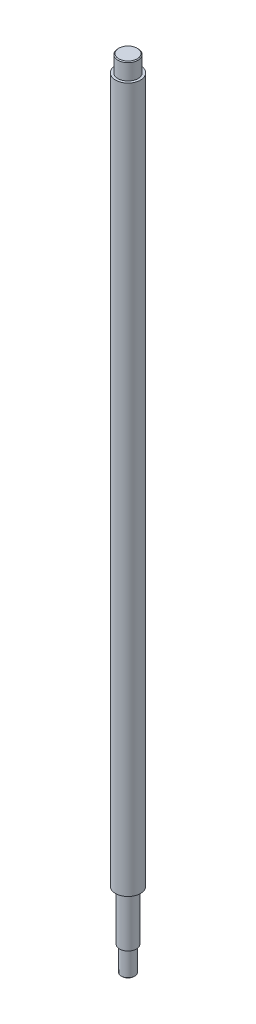
ISO-10303-21;
HEADER;
FILE_DESCRIPTION(('STEP AP214'),'2;1');
FILE_NAME('part.step','',(''),(''),'','','');
FILE_SCHEMA(('AUTOMOTIVE_DESIGN { 1 0 10303 214 1 1 1 1 }'));
ENDSEC;
DATA;
#1=APPLICATION_CONTEXT('core data for automotive mechanical design processes');
#2=APPLICATION_PROTOCOL_DEFINITION('international standard','automotive_design',2000,#1);
#3=PRODUCT_CONTEXT('',#1,'mechanical');
#4=PRODUCT('Part','Part','',(#3));
#5=PRODUCT_RELATED_PRODUCT_CATEGORY('part','',(#4));
#6=PRODUCT_DEFINITION_FORMATION('','',#4);
#7=PRODUCT_DEFINITION_CONTEXT('part definition',#1,'design');
#8=PRODUCT_DEFINITION('design','',#6,#7);
#9=PRODUCT_DEFINITION_SHAPE('','',#8);
#10=(LENGTH_UNIT() NAMED_UNIT(*) SI_UNIT(.MILLI.,.METRE.));
#11=(NAMED_UNIT(*) PLANE_ANGLE_UNIT() SI_UNIT($,.RADIAN.));
#12=(NAMED_UNIT(*) SI_UNIT($,.STERADIAN.) SOLID_ANGLE_UNIT());
#13=UNCERTAINTY_MEASURE_WITH_UNIT(LENGTH_MEASURE(1.E-05),#10,'distance_accuracy_value','');
#14=(GEOMETRIC_REPRESENTATION_CONTEXT(3) GLOBAL_UNCERTAINTY_ASSIGNED_CONTEXT((#13)) GLOBAL_UNIT_ASSIGNED_CONTEXT((#10,
#11,#12)) REPRESENTATION_CONTEXT('',''));
#15=CARTESIAN_POINT('',(0.,0.,0.));
#16=DIRECTION('',(0.,0.,1.));
#17=DIRECTION('',(1.,0.,0.));
#18=AXIS2_PLACEMENT_3D('',#15,#16,#17);
#19=CARTESIAN_POINT('',(0.,-30.,0.));
#20=DIRECTION('',(0.,-1.,0.));
#21=DIRECTION('',(0.,0.,-1.));
#22=AXIS2_PLACEMENT_3D('',#19,#20,#21);
#23=PLANE('',#22);
#24=CARTESIAN_POINT('',(0.,-30.,0.));
#25=DIRECTION('',(0.,-1.,0.));
#26=DIRECTION('',(0.,0.,-1.));
#27=AXIS2_PLACEMENT_3D('',#24,#25,#26);
#28=CIRCLE('',#27,5.);
#29=CARTESIAN_POINT('',(0.,-30.,-5.));
#30=VERTEX_POINT('',#29);
#31=EDGE_CURVE('E64',#30,#30,#28,.T.);
#32=ORIENTED_EDGE('',*,*,#31,.T.);
#33=EDGE_LOOP('',(#32));
#34=FACE_BOUND('',#33,.T.);
#35=CARTESIAN_POINT('',(0.,-30.,0.));
#36=DIRECTION('',(0.,-1.,0.));
#37=DIRECTION('',(0.,0.,-1.));
#38=AXIS2_PLACEMENT_3D('',#35,#36,#37);
#39=CIRCLE('',#38,4.);
#40=CARTESIAN_POINT('',(0.,-30.,-4.));
#41=VERTEX_POINT('',#40);
#42=EDGE_CURVE('E67',#41,#41,#39,.T.);
#43=ORIENTED_EDGE('',*,*,#42,.F.);
#44=EDGE_LOOP('',(#43));
#45=FACE_BOUND('',#44,.T.);
#46=ADVANCED_FACE('F32',(#34,#45),#23,.T.);
#47=CARTESIAN_POINT('',(0.,0.,0.));
#48=DIRECTION('',(0.,1.,0.));
#49=DIRECTION('',(0.,0.,1.));
#50=AXIS2_PLACEMENT_3D('',#47,#48,#49);
#51=PLANE('',#50);
#52=CARTESIAN_POINT('',(0.,0.,0.));
#53=DIRECTION('',(0.,1.,0.));
#54=DIRECTION('',(0.,0.,1.));
#55=AXIS2_PLACEMENT_3D('',#52,#53,#54);
#56=CIRCLE('',#55,7.5);
#57=CARTESIAN_POINT('',(0.,0.,7.5));
#58=VERTEX_POINT('',#57);
#59=EDGE_CURVE('E56',#58,#58,#56,.T.);
#60=ORIENTED_EDGE('',*,*,#59,.F.);
#61=EDGE_LOOP('',(#60));
#62=FACE_BOUND('',#61,.T.);
#63=CARTESIAN_POINT('',(0.,0.,0.));
#64=DIRECTION('',(0.,1.,0.));
#65=DIRECTION('',(0.,0.,1.));
#66=AXIS2_PLACEMENT_3D('',#63,#64,#65);
#67=CIRCLE('',#66,5.);
#68=CARTESIAN_POINT('',(0.,0.,5.));
#69=VERTEX_POINT('',#68);
#70=EDGE_CURVE('E43',#69,#69,#67,.F.);
#71=ORIENTED_EDGE('',*,*,#70,.F.);
#72=EDGE_LOOP('',(#71));
#73=FACE_BOUND('',#72,.T.);
#74=ADVANCED_FACE('F74',(#62,#73),#51,.F.);
#75=CARTESIAN_POINT('',(0.,421.,0.));
#76=DIRECTION('',(0.,1.,0.));
#77=DIRECTION('',(0.,0.,1.));
#78=AXIS2_PLACEMENT_3D('',#75,#76,#77);
#79=PLANE('',#78);
#80=CARTESIAN_POINT('',(0.,421.,0.));
#81=DIRECTION('',(0.,1.,0.));
#82=DIRECTION('',(0.,0.,1.));
#83=AXIS2_PLACEMENT_3D('',#80,#81,#82);
#84=CIRCLE('',#83,7.5);
#85=CARTESIAN_POINT('',(0.,421.,7.5));
#86=VERTEX_POINT('',#85);
#87=EDGE_CURVE('E55',#86,#86,#84,.T.);
#88=ORIENTED_EDGE('',*,*,#87,.T.);
#89=EDGE_LOOP('',(#88));
#90=FACE_BOUND('',#89,.T.);
#91=CARTESIAN_POINT('',(0.,421.,0.));
#92=DIRECTION('',(0.,1.,0.));
#93=DIRECTION('',(0.,0.,1.));
#94=AXIS2_PLACEMENT_3D('',#91,#92,#93);
#95=CIRCLE('',#94,6.);
#96=CARTESIAN_POINT('',(0.,421.,6.));
#97=VERTEX_POINT('',#96);
#98=EDGE_CURVE('E59',#97,#97,#95,.T.);
#99=ORIENTED_EDGE('',*,*,#98,.F.);
#100=EDGE_LOOP('',(#99));
#101=FACE_BOUND('',#100,.T.);
#102=ADVANCED_FACE('F80',(#90,#101),#79,.T.);
#103=CARTESIAN_POINT('',(0.,421.,0.));
#104=DIRECTION('',(0.,-1.,0.));
#105=DIRECTION('',(0.,0.,-1.));
#106=AXIS2_PLACEMENT_3D('',#103,#104,#105);
#107=CYLINDRICAL_SURFACE('',#106,7.5);
#108=ORIENTED_EDGE('',*,*,#87,.F.);
#109=EDGE_LOOP('',(#108));
#110=FACE_BOUND('',#109,.T.);
#111=ORIENTED_EDGE('',*,*,#59,.T.);
#112=EDGE_LOOP('',(#111));
#113=FACE_BOUND('',#112,.T.);
#114=ADVANCED_FACE('F98',(#110,#113),#107,.T.);
#115=CARTESIAN_POINT('',(0.,431.,0.));
#116=DIRECTION('',(0.,-1.,0.));
#117=DIRECTION('',(0.,0.,-1.));
#118=AXIS2_PLACEMENT_3D('',#115,#116,#117);
#119=CYLINDRICAL_SURFACE('',#118,6.);
#120=CARTESIAN_POINT('',(0.,430.5,0.));
#121=DIRECTION('',(0.,1.,0.));
#122=DIRECTION('',(0.,0.,1.));
#123=AXIS2_PLACEMENT_3D('',#120,#121,#122);
#124=CIRCLE('',#123,6.);
#125=CARTESIAN_POINT('',(0.,430.5,6.));
#126=VERTEX_POINT('',#125);
#127=EDGE_CURVE('E47',#126,#126,#124,.F.);
#128=ORIENTED_EDGE('',*,*,#127,.T.);
#129=EDGE_LOOP('',(#128));
#130=FACE_BOUND('',#129,.T.);
#131=ORIENTED_EDGE('',*,*,#98,.T.);
#132=EDGE_LOOP('',(#131));
#133=FACE_BOUND('',#132,.T.);
#134=ADVANCED_FACE('F94',(#130,#133),#119,.T.);
#135=CARTESIAN_POINT('',(0.,431.,0.));
#136=DIRECTION('',(0.,1.,0.));
#137=DIRECTION('',(0.,0.,1.));
#138=AXIS2_PLACEMENT_3D('',#135,#136,#137);
#139=PLANE('',#138);
#140=CARTESIAN_POINT('',(0.,431.,0.));
#141=DIRECTION('',(0.,1.,0.));
#142=DIRECTION('',(0.,0.,1.));
#143=AXIS2_PLACEMENT_3D('',#140,#141,#142);
#144=CIRCLE('',#143,5.49999999999995);
#145=CARTESIAN_POINT('',(0.,431.,5.49999999999995));
#146=VERTEX_POINT('',#145);
#147=EDGE_CURVE('E52',#146,#146,#144,.T.);
#148=ORIENTED_EDGE('',*,*,#147,.T.);
#149=EDGE_LOOP('',(#148));
#150=FACE_BOUND('',#149,.T.);
#151=ADVANCED_FACE('F91',(#150),#139,.T.);
#152=CARTESIAN_POINT('',(0.,431.,0.));
#153=DIRECTION('',(0.,-1.,0.));
#154=DIRECTION('',(0.,0.,-1.));
#155=AXIS2_PLACEMENT_3D('',#152,#153,#154);
#156=CONICAL_SURFACE('',#155,5.49999999999995,0.785398163397444);
#157=ORIENTED_EDGE('',*,*,#127,.F.);
#158=EDGE_LOOP('',(#157));
#159=FACE_BOUND('',#158,.T.);
#160=ORIENTED_EDGE('',*,*,#147,.F.);
#161=EDGE_LOOP('',(#160));
#162=FACE_BOUND('',#161,.T.);
#163=ADVANCED_FACE('F89',(#159,#162),#156,.T.);
#164=CARTESIAN_POINT('',(0.,-30.,0.));
#165=DIRECTION('',(0.,1.,0.));
#166=DIRECTION('',(0.,0.,1.));
#167=AXIS2_PLACEMENT_3D('',#164,#165,#166);
#168=CYLINDRICAL_SURFACE('',#167,5.);
#169=ORIENTED_EDGE('',*,*,#31,.F.);
#170=EDGE_LOOP('',(#169));
#171=FACE_BOUND('',#170,.T.);
#172=ORIENTED_EDGE('',*,*,#70,.T.);
#173=EDGE_LOOP('',(#172));
#174=FACE_BOUND('',#173,.T.);
#175=ADVANCED_FACE('F86',(#171,#174),#168,.T.);
#176=CARTESIAN_POINT('',(0.,-45.,0.));
#177=DIRECTION('',(0.,1.,0.));
#178=DIRECTION('',(0.,0.,1.));
#179=AXIS2_PLACEMENT_3D('',#176,#177,#178);
#180=CYLINDRICAL_SURFACE('',#179,4.);
#181=CARTESIAN_POINT('',(0.,-44.5,0.));
#182=DIRECTION('',(0.,-1.,0.));
#183=DIRECTION('',(0.,0.,-1.));
#184=AXIS2_PLACEMENT_3D('',#181,#182,#183);
#185=CIRCLE('',#184,4.);
#186=CARTESIAN_POINT('',(0.,-44.5,-4.));
#187=VERTEX_POINT('',#186);
#188=EDGE_CURVE('E10',#187,#187,#185,.F.);
#189=ORIENTED_EDGE('',*,*,#188,.T.);
#190=EDGE_LOOP('',(#189));
#191=FACE_BOUND('',#190,.T.);
#192=ORIENTED_EDGE('',*,*,#42,.T.);
#193=EDGE_LOOP('',(#192));
#194=FACE_BOUND('',#193,.T.);
#195=ADVANCED_FACE('F71',(#191,#194),#180,.T.);
#196=CARTESIAN_POINT('',(0.,-45.,0.));
#197=DIRECTION('',(0.,-1.,0.));
#198=DIRECTION('',(0.,0.,-1.));
#199=AXIS2_PLACEMENT_3D('',#196,#197,#198);
#200=PLANE('',#199);
#201=CARTESIAN_POINT('',(0.,-45.,0.));
#202=DIRECTION('',(0.,-1.,0.));
#203=DIRECTION('',(0.,0.,-1.));
#204=AXIS2_PLACEMENT_3D('',#201,#202,#203);
#205=CIRCLE('',#204,3.5);
#206=CARTESIAN_POINT('',(0.,-45.,-3.5));
#207=VERTEX_POINT('',#206);
#208=EDGE_CURVE('E39',#207,#207,#205,.T.);
#209=ORIENTED_EDGE('',*,*,#208,.T.);
#210=EDGE_LOOP('',(#209));
#211=FACE_BOUND('',#210,.T.);
#212=ADVANCED_FACE('F128',(#211),#200,.T.);
#213=CARTESIAN_POINT('',(0.,-45.,0.));
#214=DIRECTION('',(0.,1.,0.));
#215=DIRECTION('',(0.,0.,1.));
#216=AXIS2_PLACEMENT_3D('',#213,#214,#215);
#217=CONICAL_SURFACE('',#216,3.5,0.785398163397437);
#218=ORIENTED_EDGE('',*,*,#188,.F.);
#219=EDGE_LOOP('',(#218));
#220=FACE_BOUND('',#219,.T.);
#221=ORIENTED_EDGE('',*,*,#208,.F.);
#222=EDGE_LOOP('',(#221));
#223=FACE_BOUND('',#222,.T.);
#224=ADVANCED_FACE('F34',(#220,#223),#217,.T.);
#225=CLOSED_SHELL('',(#46,#74,#102,#114,#134,#151,#163,#175,#195,#212,#224));
#226=MANIFOLD_SOLID_BREP('B2',#225);
#227=ADVANCED_BREP_SHAPE_REPRESENTATION('',(#18,#226),#14);
#228=SHAPE_DEFINITION_REPRESENTATION(#9,#227);
ENDSEC;
END-ISO-10303-21;
